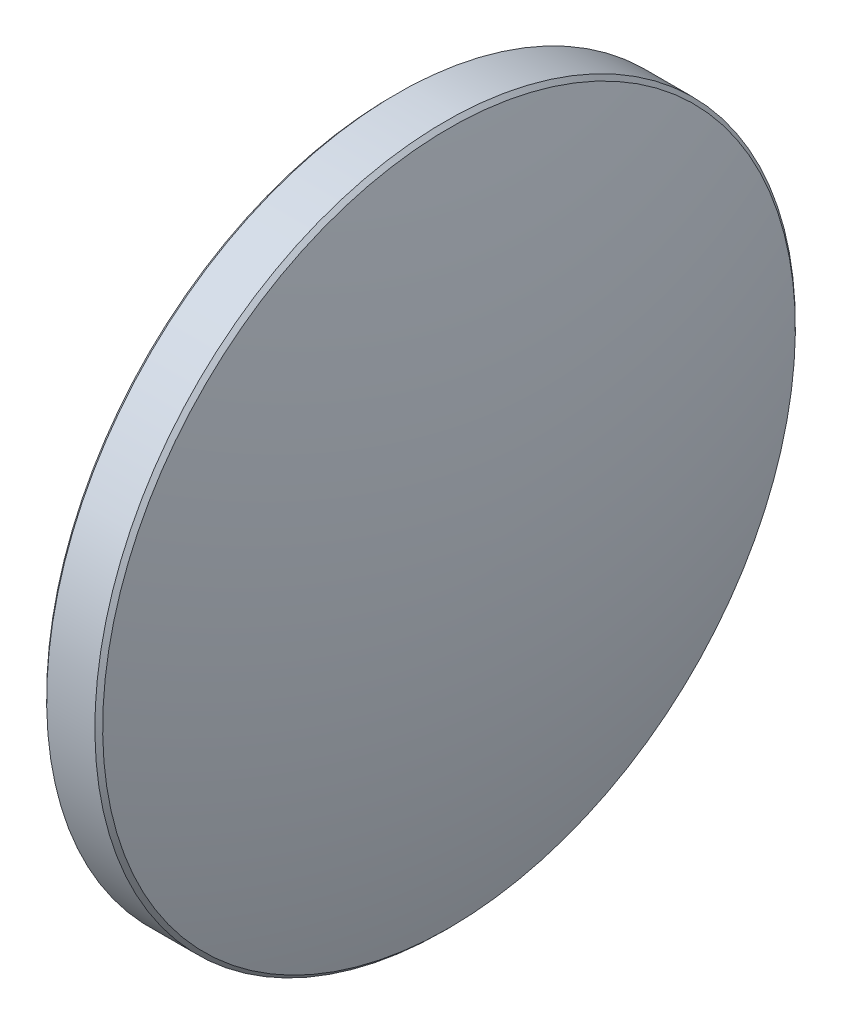
ISO-10303-21;
HEADER;
FILE_DESCRIPTION(('STEP AP214'),'2;1');
FILE_NAME('part.step','',(''),(''),'','','');
FILE_SCHEMA(('AUTOMOTIVE_DESIGN { 1 0 10303 214 1 1 1 1 }'));
ENDSEC;
DATA;
#1=APPLICATION_CONTEXT('core data for automotive mechanical design processes');
#2=APPLICATION_PROTOCOL_DEFINITION('international standard','automotive_design',2000,#1);
#3=PRODUCT_CONTEXT('',#1,'mechanical');
#4=PRODUCT('Part','Part','',(#3));
#5=PRODUCT_RELATED_PRODUCT_CATEGORY('part','',(#4));
#6=PRODUCT_DEFINITION_FORMATION('','',#4);
#7=PRODUCT_DEFINITION_CONTEXT('part definition',#1,'design');
#8=PRODUCT_DEFINITION('design','',#6,#7);
#9=PRODUCT_DEFINITION_SHAPE('','',#8);
#10=(LENGTH_UNIT() NAMED_UNIT(*) SI_UNIT(.MILLI.,.METRE.));
#11=(NAMED_UNIT(*) PLANE_ANGLE_UNIT() SI_UNIT($,.RADIAN.));
#12=(NAMED_UNIT(*) SI_UNIT($,.STERADIAN.) SOLID_ANGLE_UNIT());
#13=UNCERTAINTY_MEASURE_WITH_UNIT(LENGTH_MEASURE(1.E-05),#10,'distance_accuracy_value','');
#14=(GEOMETRIC_REPRESENTATION_CONTEXT(3) GLOBAL_UNCERTAINTY_ASSIGNED_CONTEXT((#13)) GLOBAL_UNIT_ASSIGNED_CONTEXT((#10,
#11,#12)) REPRESENTATION_CONTEXT('',''));
#15=CARTESIAN_POINT('',(0.,0.,0.));
#16=DIRECTION('',(0.,0.,1.));
#17=DIRECTION('',(1.,0.,0.));
#18=AXIS2_PLACEMENT_3D('',#15,#16,#17);
#19=CARTESIAN_POINT('',(42.0644787698177,0.174259059360243,0.09771937612868));
#20=DIRECTION('',(0.,0.,-1.));
#21=DIRECTION('',(0.,-1.,0.));
#22=AXIS2_PLACEMENT_3D('',#19,#20,#21);
#23=CIRCLE('',#22,45.1);
#24=TRIMMED_CURVE('',#23,(PARAMETER_VALUE(-1.56693247994444)),
(PARAMETER_VALUE(1.56693247994444)),.T.,.PARAMETER.);
#25=CARTESIAN_POINT('',(42.0644787698177,0.,0.09771937612868));
#26=DIRECTION('',(-1.,0.,0.));
#27=AXIS1_PLACEMENT('',#25,#26);
#28=SURFACE_OF_REVOLUTION('',#24,#27);
#29=CARTESIAN_POINT('',(-3.0351845746046,0.,0.09771937612868));
#30=VERTEX_POINT('',#29);
#31=VERTEX_LOOP('',#30);
#32=FACE_BOUND('',#31,.T.);
#33=CARTESIAN_POINT('',(-1.20080574358784,0.,0.09771937612868));
#34=DIRECTION('',(-1.,0.,0.));
#35=DIRECTION('',(0.,-1.,0.));
#36=AXIS2_PLACEMENT_3D('',#33,#34,#35);
#37=CIRCLE('',#36,12.5585786437627);
#38=CARTESIAN_POINT('',(-1.20080574358783,-12.5585786437627,0.09771937612868));
#39=VERTEX_POINT('',#38);
#40=EDGE_CURVE('E10',#39,#39,#37,.T.);
#41=ORIENTED_EDGE('',*,*,#40,.T.);
#42=EDGE_LOOP('',(#41));
#43=FACE_BOUND('',#42,.T.);
#44=ADVANCED_FACE('F15',(#32,#43),#28,.T.);
#45=CARTESIAN_POINT('',(-1.05938438735053,0.,0.09771937612868));
#46=DIRECTION('',(1.,0.,0.));
#47=DIRECTION('',(0.,1.,0.));
#48=AXIS2_PLACEMENT_3D('',#45,#46,#47);
#49=CONICAL_SURFACE('',#48,12.7,0.785398163397438);
#50=ORIENTED_EDGE('',*,*,#40,.F.);
#51=EDGE_LOOP('',(#50));
#52=FACE_BOUND('',#51,.T.);
#53=CARTESIAN_POINT('',(-1.05938438735053,0.,0.09771937612868));
#54=DIRECTION('',(-1.,0.,0.));
#55=DIRECTION('',(0.,-1.,0.));
#56=AXIS2_PLACEMENT_3D('',#53,#54,#55);
#57=CIRCLE('',#56,12.7);
#58=CARTESIAN_POINT('',(-1.05938438735052,-12.7,0.09771937612868));
#59=VERTEX_POINT('',#58);
#60=EDGE_CURVE('E22',#59,#59,#57,.T.);
#61=ORIENTED_EDGE('',*,*,#60,.T.);
#62=EDGE_LOOP('',(#61));
#63=FACE_BOUND('',#62,.T.);
#64=ADVANCED_FACE('F30',(#52,#63),#49,.T.);
#65=CARTESIAN_POINT('',(-3.0351845746046,0.,0.09771937612868));
#66=DIRECTION('',(-1.,0.,0.));
#67=DIRECTION('',(0.,-1.,0.));
#68=AXIS2_PLACEMENT_3D('',#65,#66,#67);
#69=CYLINDRICAL_SURFACE('',#68,12.7);
#70=ORIENTED_EDGE('',*,*,#60,.F.);
#71=EDGE_LOOP('',(#70));
#72=FACE_BOUND('',#71,.T.);
#73=CARTESIAN_POINT('',(0.68901523814133,0.,0.09771937612868));
#74=DIRECTION('',(-1.,0.,0.));
#75=DIRECTION('',(0.,-1.,0.));
#76=AXIS2_PLACEMENT_3D('',#73,#74,#75);
#77=CIRCLE('',#76,12.7);
#78=CARTESIAN_POINT('',(0.689015238141332,-12.7,0.09771937612868));
#79=VERTEX_POINT('',#78);
#80=EDGE_CURVE('E39',#79,#79,#77,.T.);
#81=ORIENTED_EDGE('',*,*,#80,.T.);
#82=EDGE_LOOP('',(#81));
#83=FACE_BOUND('',#82,.T.);
#84=ADVANCED_FACE('F35',(#72,#83),#69,.T.);
#85=CARTESIAN_POINT('',(0.83043659437864,0.,0.09771937612868));
#86=DIRECTION('',(-1.,0.,0.));
#87=DIRECTION('',(0.,-1.,0.));
#88=AXIS2_PLACEMENT_3D('',#85,#86,#87);
#89=CONICAL_SURFACE('',#88,12.5585786437627,0.785398163397439);
#90=ORIENTED_EDGE('',*,*,#80,.F.);
#91=EDGE_LOOP('',(#90));
#92=FACE_BOUND('',#91,.T.);
#93=CARTESIAN_POINT('',(0.83043659437864,0.,0.09771937612868));
#94=DIRECTION('',(-1.,0.,0.));
#95=DIRECTION('',(0.,-1.,0.));
#96=AXIS2_PLACEMENT_3D('',#93,#94,#95);
#97=CIRCLE('',#96,12.5585786437627);
#98=CARTESIAN_POINT('',(0.830436594378643,-12.5585786437627,0.09771937612868));
#99=VERTEX_POINT('',#98);
#100=EDGE_CURVE('E41',#99,#99,#97,.T.);
#101=ORIENTED_EDGE('',*,*,#100,.T.);
#102=EDGE_LOOP('',(#101));
#103=FACE_BOUND('',#102,.T.);
#104=ADVANCED_FACE('F47',(#92,#103),#89,.T.);
#105=CARTESIAN_POINT('',(-42.4348479190269,0.174259059360217,0.09771937612868));
#106=DIRECTION('',(0.,0.,-1.));
#107=DIRECTION('',(0.,-1.,0.));
#108=AXIS2_PLACEMENT_3D('',#105,#106,#107);
#109=CIRCLE('',#108,45.1);
#110=TRIMMED_CURVE('',#109,(PARAMETER_VALUE(-1.56693247994444)),
(PARAMETER_VALUE(1.56693247994444)),.T.,.PARAMETER.);
#111=CARTESIAN_POINT('',(-42.4348479190269,0.,0.09771937612868));
#112=DIRECTION('',(-1.,0.,0.));
#113=AXIS1_PLACEMENT('',#111,#112);
#114=SURFACE_OF_REVOLUTION('',#110,#113);
#115=ORIENTED_EDGE('',*,*,#100,.F.);
#116=EDGE_LOOP('',(#115));
#117=FACE_BOUND('',#116,.T.);
#118=CARTESIAN_POINT('',(2.6648154253954,0.,0.09771937612868));
#119=VERTEX_POINT('',#118);
#120=VERTEX_LOOP('',#119);
#121=FACE_BOUND('',#120,.T.);
#122=ADVANCED_FACE('F49',(#117,#121),#114,.T.);
#123=CLOSED_SHELL('',(#44,#64,#84,#104,#122));
#124=MANIFOLD_SOLID_BREP('B1',#123);
#125=ADVANCED_BREP_SHAPE_REPRESENTATION('',(#18,#124),#14);
#126=SHAPE_DEFINITION_REPRESENTATION(#9,#125);
ENDSEC;
END-ISO-10303-21;
